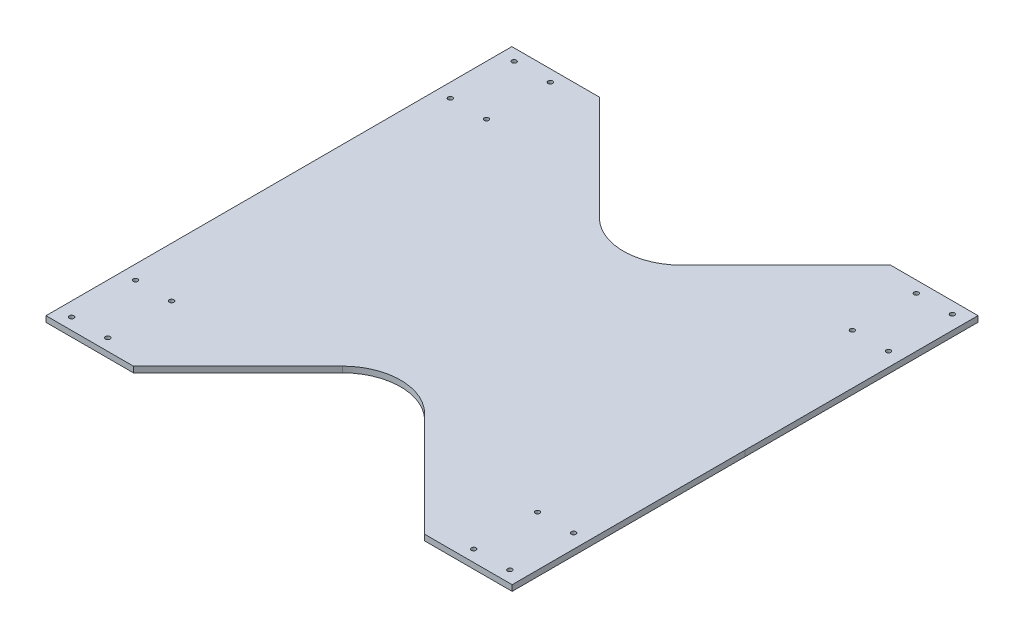
ISO-10303-21;
HEADER;
FILE_DESCRIPTION(('STEP AP214'),'2;1');
FILE_NAME('part.step','',(''),(''),'','','');
FILE_SCHEMA(('AUTOMOTIVE_DESIGN { 1 0 10303 214 1 1 1 1 }'));
ENDSEC;
DATA;
#1=APPLICATION_CONTEXT('core data for automotive mechanical design processes');
#2=APPLICATION_PROTOCOL_DEFINITION('international standard','automotive_design',2000,#1);
#3=PRODUCT_CONTEXT('',#1,'mechanical');
#4=PRODUCT('Part','Part','',(#3));
#5=PRODUCT_RELATED_PRODUCT_CATEGORY('part','',(#4));
#6=PRODUCT_DEFINITION_FORMATION('','',#4);
#7=PRODUCT_DEFINITION_CONTEXT('part definition',#1,'design');
#8=PRODUCT_DEFINITION('design','',#6,#7);
#9=PRODUCT_DEFINITION_SHAPE('','',#8);
#10=(LENGTH_UNIT() NAMED_UNIT(*) SI_UNIT(.MILLI.,.METRE.));
#11=(NAMED_UNIT(*) PLANE_ANGLE_UNIT() SI_UNIT($,.RADIAN.));
#12=(NAMED_UNIT(*) SI_UNIT($,.STERADIAN.) SOLID_ANGLE_UNIT());
#13=UNCERTAINTY_MEASURE_WITH_UNIT(LENGTH_MEASURE(1.E-05),#10,'distance_accuracy_value','');
#14=(GEOMETRIC_REPRESENTATION_CONTEXT(3) GLOBAL_UNCERTAINTY_ASSIGNED_CONTEXT((#13)) GLOBAL_UNIT_ASSIGNED_CONTEXT((#10,
#11,#12)) REPRESENTATION_CONTEXT('',''));
#15=CARTESIAN_POINT('',(0.,0.,0.));
#16=DIRECTION('',(0.,0.,1.));
#17=DIRECTION('',(1.,0.,0.));
#18=AXIS2_PLACEMENT_3D('',#15,#16,#17);
#19=CARTESIAN_POINT('',(0.,5.,0.));
#20=DIRECTION('',(0.,1.,0.));
#21=DIRECTION('',(0.,0.,1.));
#22=AXIS2_PLACEMENT_3D('',#19,#20,#21);
#23=PLANE('',#22);
#24=CARTESIAN_POINT('',(-328.438138966952,5.,-193.693066961914));
#25=DIRECTION('',(0.,1.,0.));
#26=DIRECTION('',(0.,0.,-1.));
#27=AXIS2_PLACEMENT_3D('',#24,#25,#26);
#28=CIRCLE('',#27,1.94999999999997);
#29=CARTESIAN_POINT('',(-328.438138966952,5.,-195.643066961914));
#30=VERTEX_POINT('',#29);
#31=EDGE_CURVE('E502',#30,#30,#28,.T.);
#32=ORIENTED_EDGE('',*,*,#31,.F.);
#33=EDGE_LOOP('',(#32));
#34=FACE_BOUND('',#33,.T.);
#35=CARTESIAN_POINT('',(-359.412846634247,5.,-138.838777385568));
#36=DIRECTION('',(0.,1.,0.));
#37=DIRECTION('',(0.,0.,-1.));
#38=AXIS2_PLACEMENT_3D('',#35,#36,#37);
#39=CIRCLE('',#38,1.94999999999997);
#40=CARTESIAN_POINT('',(-359.412846634247,5.,-140.788777385568));
#41=VERTEX_POINT('',#40);
#42=EDGE_CURVE('E522',#41,#41,#39,.T.);
#43=ORIENTED_EDGE('',*,*,#42,.F.);
#44=EDGE_LOOP('',(#43));
#45=FACE_BOUND('',#44,.T.);
#46=CARTESIAN_POINT('',(-328.350517382651,5.,131.486741949441));
#47=DIRECTION('',(0.,1.,0.));
#48=DIRECTION('',(0.,0.,1.));
#49=AXIS2_PLACEMENT_3D('',#46,#47,#48);
#50=CIRCLE('',#49,1.95000000000013);
#51=CARTESIAN_POINT('',(-328.350517382651,5.,133.436741949441));
#52=VERTEX_POINT('',#51);
#53=EDGE_CURVE('E534',#52,#52,#50,.T.);
#54=ORIENTED_EDGE('',*,*,#53,.F.);
#55=EDGE_LOOP('',(#54));
#56=FACE_BOUND('',#55,.T.);
#57=CARTESIAN_POINT('',(-14.2974814610924,5.,186.254330396367));
#58=DIRECTION('',(0.,1.,0.));
#59=DIRECTION('',(0.,0.,-1.));
#60=AXIS2_PLACEMENT_3D('',#57,#58,#59);
#61=CIRCLE('',#60,1.94999999999994);
#62=CARTESIAN_POINT('',(-14.2974814610924,5.,184.304330396367));
#63=VERTEX_POINT('',#62);
#64=EDGE_CURVE('E546',#63,#63,#61,.T.);
#65=ORIENTED_EDGE('',*,*,#64,.F.);
#66=EDGE_LOOP('',(#65));
#67=FACE_BOUND('',#66,.T.);
#68=CARTESIAN_POINT('',(-14.3227704976897,5.,131.414336227288));
#69=DIRECTION('',(0.,1.,0.));
#70=DIRECTION('',(0.,0.,-1.));
#71=AXIS2_PLACEMENT_3D('',#68,#69,#70);
#72=CIRCLE('',#71,1.95000000000007);
#73=CARTESIAN_POINT('',(-14.3227704976897,5.,129.464336227288));
#74=VERTEX_POINT('',#73);
#75=EDGE_CURVE('E558',#74,#74,#72,.T.);
#76=ORIENTED_EDGE('',*,*,#75,.F.);
#77=EDGE_LOOP('',(#76));
#78=FACE_BOUND('',#77,.T.);
#79=CARTESIAN_POINT('',(-328.350517382651,5.,186.326741949441));
#80=DIRECTION('',(0.,1.,0.));
#81=DIRECTION('',(0.,0.,1.));
#82=AXIS2_PLACEMENT_3D('',#79,#80,#81);
#83=CIRCLE('',#82,1.94999999999992);
#84=CARTESIAN_POINT('',(-328.350517382651,5.,188.276741949441));
#85=VERTEX_POINT('',#84);
#86=EDGE_CURVE('E570',#85,#85,#83,.T.);
#87=ORIENTED_EDGE('',*,*,#86,.F.);
#88=EDGE_LOOP('',(#87));
#89=FACE_BOUND('',#88,.T.);
#90=CARTESIAN_POINT('',(-14.3851030453936,5.,-138.925478514988));
#91=DIRECTION('',(0.,1.,0.));
#92=DIRECTION('',(0.,0.,1.));
#93=AXIS2_PLACEMENT_3D('',#90,#91,#92);
#94=CIRCLE('',#93,1.95000000000001);
#95=CARTESIAN_POINT('',(-14.3851030453936,5.,-136.975478514988));
#96=VERTEX_POINT('',#95);
#97=EDGE_CURVE('E582',#96,#96,#94,.T.);
#98=ORIENTED_EDGE('',*,*,#97,.F.);
#99=EDGE_LOOP('',(#98));
#100=FACE_BOUND('',#99,.T.);
#101=CARTESIAN_POINT('',(16.6148969546064,5.,-193.765478514988));
#102=DIRECTION('',(0.,1.,0.));
#103=DIRECTION('',(0.,0.,1.));
#104=AXIS2_PLACEMENT_3D('',#101,#102,#103);
#105=CIRCLE('',#104,1.95);
#106=CARTESIAN_POINT('',(16.6148969546064,5.,-191.815478514988));
#107=VERTEX_POINT('',#106);
#108=EDGE_CURVE('E594',#107,#107,#105,.T.);
#109=ORIENTED_EDGE('',*,*,#108,.F.);
#110=EDGE_LOOP('',(#109));
#111=FACE_BOUND('',#110,.T.);
#112=DIRECTION('',(-0.706976362509081,0.,0.707237175814047));
#113=VECTOR('',#112,1.);
#114=CARTESIAN_POINT('',(-171.385103045394,5.,-78.7193642955467));
#115=LINE('',#114,#113);
#116=CARTESIAN_POINT('',(-46.3851030453936,5.,-203.765478514988));
#117=VERTEX_POINT('',#116);
#118=CARTESIAN_POINT('',(-136.039547340555,5.,-114.077959462082));
#119=VERTEX_POINT('',#118);
#120=EDGE_CURVE('E616',#117,#119,#115,.T.);
#121=ORIENTED_EDGE('',*,*,#120,.T.);
#122=CARTESIAN_POINT('',(-171.401406131257,5.,-149.426777587536));
#123=DIRECTION('',(0.,1.,0.));
#124=DIRECTION('',(0.,0.,1.));
#125=AXIS2_PLACEMENT_3D('',#122,#123,#124);
#126=CIRCLE('',#125,50.);
#127=CARTESIAN_POINT('',(-206.746960331379,5.,-114.061656376288));
#128=VERTEX_POINT('',#127);
#129=EDGE_CURVE('E142',#119,#128,#126,.F.);
#130=ORIENTED_EDGE('',*,*,#129,.T.);
#131=DIRECTION('',(-0.707302424224961,0.,-0.706911084002432));
#132=VECTOR('',#131,1.);
#133=CARTESIAN_POINT('',(-171.385103045394,5.,-78.7193642955467));
#134=LINE('',#133,#132);
#135=CARTESIAN_POINT('',(-296.442753791085,5.,-203.707822448091));
#136=VERTEX_POINT('',#135);
#137=EDGE_CURVE('E135',#128,#136,#134,.T.);
#138=ORIENTED_EDGE('',*,*,#137,.T.);
#139=DIRECTION('',(-0.999999893673944,0.,0.000461142169899675));
#140=VECTOR('',#139,1.);
#141=CARTESIAN_POINT('',(-296.442753791085,5.,-203.707822448091));
#142=LINE('',#141,#140);
#143=CARTESIAN_POINT('',(-371.442745816631,5.,-203.673236785348));
#144=VERTEX_POINT('',#143);
#145=EDGE_CURVE('E139',#136,#144,#142,.T.);
#146=ORIENTED_EDGE('',*,*,#145,.T.);
#147=DIRECTION('',(0.000461142169899398,0.,0.999999893673944));
#148=VECTOR('',#147,1.);
#149=CARTESIAN_POINT('',(-371.442745816631,5.,-203.673236785348));
#150=LINE('',#149,#148);
#151=CARTESIAN_POINT('',(-371.350517382651,5.,-3.67325805055938));
#152=VERTEX_POINT('',#151);
#153=EDGE_CURVE('E156',#144,#152,#150,.T.);
#154=ORIENTED_EDGE('',*,*,#153,.T.);
#155=DIRECTION('',(0.,0.,1.));
#156=VECTOR('',#155,1.);
#157=CARTESIAN_POINT('',(-371.350517382651,5.,196.326741949441));
#158=LINE('',#157,#156);
#159=CARTESIAN_POINT('',(-371.350517382651,5.,196.326741949441));
#160=VERTEX_POINT('',#159);
#161=EDGE_CURVE('E600',#152,#160,#158,.T.);
#162=ORIENTED_EDGE('',*,*,#161,.T.);
#163=DIRECTION('',(1.,0.,0.));
#164=VECTOR('',#163,1.);
#165=CARTESIAN_POINT('',(-296.350517382651,5.,196.326741949441));
#166=LINE('',#165,#164);
#167=CARTESIAN_POINT('',(-296.350517382651,5.,196.326741949441));
#168=VERTEX_POINT('',#167);
#169=EDGE_CURVE('E602',#160,#168,#166,.T.);
#170=ORIENTED_EDGE('',*,*,#169,.T.);
#171=DIRECTION('',(0.70697636250908,0.,-0.707237175814047));
#172=VECTOR('',#171,1.);
#173=CARTESIAN_POINT('',(-171.350517382651,5.,71.2806277299991));
#174=LINE('',#173,#172);
#175=CARTESIAN_POINT('',(-206.69607308749,5.,106.639222896534));
#176=VERTEX_POINT('',#175);
#177=EDGE_CURVE('E604',#168,#176,#174,.T.);
#178=ORIENTED_EDGE('',*,*,#177,.T.);
#179=CARTESIAN_POINT('',(-171.334214296788,5.,141.988041021988));
#180=DIRECTION('',(0.,1.,0.));
#181=DIRECTION('',(0.,0.,1.));
#182=AXIS2_PLACEMENT_3D('',#179,#180,#181);
#183=CIRCLE('',#182,50.);
#184=CARTESIAN_POINT('',(-135.988660096666,5.,106.62291981074));
#185=VERTEX_POINT('',#184);
#186=EDGE_CURVE('E11',#176,#185,#183,.F.);
#187=ORIENTED_EDGE('',*,*,#186,.T.);
#188=DIRECTION('',(0.707302424224961,0.,0.706911084002432));
#189=VECTOR('',#188,1.);
#190=CARTESIAN_POINT('',(-171.350517382651,5.,71.2806277299991));
#191=LINE('',#190,#189);
#192=CARTESIAN_POINT('',(-46.2928666369596,5.,196.269085882543));
#193=VERTEX_POINT('',#192);
#194=EDGE_CURVE('E606',#185,#193,#191,.T.);
#195=ORIENTED_EDGE('',*,*,#194,.T.);
#196=DIRECTION('',(0.999999893673944,0.,-0.000461142169899305));
#197=VECTOR('',#196,1.);
#198=CARTESIAN_POINT('',(-46.2928666369596,5.,196.269085882543));
#199=LINE('',#198,#197);
#200=CARTESIAN_POINT('',(28.7071253885862,5.,196.234500219801));
#201=VERTEX_POINT('',#200);
#202=EDGE_CURVE('E608',#193,#201,#199,.T.);
#203=ORIENTED_EDGE('',*,*,#202,.T.);
#204=DIRECTION('',(-0.000461142169898981,0.,-0.999999893673944));
#205=VECTOR('',#204,1.);
#206=CARTESIAN_POINT('',(28.7071253885862,5.,196.234500219801));
#207=LINE('',#206,#205);
#208=CARTESIAN_POINT('',(28.6148969546064,5.,-3.76547851498826));
#209=VERTEX_POINT('',#208);
#210=EDGE_CURVE('E610',#201,#209,#207,.T.);
#211=ORIENTED_EDGE('',*,*,#210,.T.);
#212=DIRECTION('',(0.,0.,-1.));
#213=VECTOR('',#212,1.);
#214=CARTESIAN_POINT('',(28.6148969546064,5.,-203.765478514988));
#215=LINE('',#214,#213);
#216=CARTESIAN_POINT('',(28.6148969546064,5.,-203.765478514988));
#217=VERTEX_POINT('',#216);
#218=EDGE_CURVE('E612',#209,#217,#215,.T.);
#219=ORIENTED_EDGE('',*,*,#218,.T.);
#220=DIRECTION('',(-1.,0.,0.));
#221=VECTOR('',#220,1.);
#222=CARTESIAN_POINT('',(-46.3851030453936,5.,-203.765478514988));
#223=LINE('',#222,#221);
#224=EDGE_CURVE('E614',#217,#117,#223,.T.);
#225=ORIENTED_EDGE('',*,*,#224,.T.);
#226=EDGE_LOOP('',(#121,#130,#138,#146,#154,#162,#170,#178,#187,#195,#203,#211,#219,#225));
#227=FACE_BOUND('',#226,.T.);
#228=CARTESIAN_POINT('',(-14.3851030453936,5.,-193.765478514988));
#229=DIRECTION('',(0.,1.,0.));
#230=DIRECTION('',(0.,0.,1.));
#231=AXIS2_PLACEMENT_3D('',#228,#229,#230);
#232=CIRCLE('',#231,1.95000000000001);
#233=CARTESIAN_POINT('',(-14.3851030453936,5.,-191.815478514988));
#234=VERTEX_POINT('',#233);
#235=EDGE_CURVE('E588',#234,#234,#232,.T.);
#236=ORIENTED_EDGE('',*,*,#235,.F.);
#237=EDGE_LOOP('',(#236));
#238=FACE_BOUND('',#237,.T.);
#239=CARTESIAN_POINT('',(16.6148969546064,5.,-138.925478514988));
#240=DIRECTION('',(0.,1.,0.));
#241=DIRECTION('',(0.,0.,1.));
#242=AXIS2_PLACEMENT_3D('',#239,#240,#241);
#243=CIRCLE('',#242,1.95);
#244=CARTESIAN_POINT('',(16.6148969546064,5.,-136.975478514988));
#245=VERTEX_POINT('',#244);
#246=EDGE_CURVE('E576',#245,#245,#243,.T.);
#247=ORIENTED_EDGE('',*,*,#246,.F.);
#248=EDGE_LOOP('',(#247));
#249=FACE_BOUND('',#248,.T.);
#250=CARTESIAN_POINT('',(16.6772262062025,5.,131.400040820021));
#251=DIRECTION('',(0.,1.,0.));
#252=DIRECTION('',(0.,0.,-1.));
#253=AXIS2_PLACEMENT_3D('',#250,#251,#252);
#254=CIRCLE('',#253,1.94999999999999);
#255=CARTESIAN_POINT('',(16.6772262062025,5.,129.450040820021));
#256=VERTEX_POINT('',#255);
#257=EDGE_CURVE('E564',#256,#256,#254,.T.);
#258=ORIENTED_EDGE('',*,*,#257,.F.);
#259=EDGE_LOOP('',(#258));
#260=FACE_BOUND('',#259,.T.);
#261=CARTESIAN_POINT('',(16.7025152427999,5.,186.2400349891));
#262=DIRECTION('',(0.,1.,0.));
#263=DIRECTION('',(0.,0.,-1.));
#264=AXIS2_PLACEMENT_3D('',#261,#262,#263);
#265=CIRCLE('',#264,1.9499999999999);
#266=CARTESIAN_POINT('',(16.7025152427999,5.,184.2900349891));
#267=VERTEX_POINT('',#266);
#268=EDGE_CURVE('E552',#267,#267,#265,.T.);
#269=ORIENTED_EDGE('',*,*,#268,.F.);
#270=EDGE_LOOP('',(#269));
#271=FACE_BOUND('',#270,.T.);
#272=CARTESIAN_POINT('',(-359.350517382651,5.,186.326741949441));
#273=DIRECTION('',(0.,1.,0.));
#274=DIRECTION('',(0.,0.,1.));
#275=AXIS2_PLACEMENT_3D('',#272,#273,#274);
#276=CIRCLE('',#275,1.94999999999987);
#277=CARTESIAN_POINT('',(-359.350517382651,5.,188.276741949441));
#278=VERTEX_POINT('',#277);
#279=EDGE_CURVE('E540',#278,#278,#276,.T.);
#280=ORIENTED_EDGE('',*,*,#279,.F.);
#281=EDGE_LOOP('',(#280));
#282=FACE_BOUND('',#281,.T.);
#283=CARTESIAN_POINT('',(-359.350517382651,5.,131.486741949441));
#284=DIRECTION('',(0.,1.,0.));
#285=DIRECTION('',(0.,0.,1.));
#286=AXIS2_PLACEMENT_3D('',#283,#284,#285);
#287=CIRCLE('',#286,1.94999999999994);
#288=CARTESIAN_POINT('',(-359.350517382651,5.,133.436741949441));
#289=VERTEX_POINT('',#288);
#290=EDGE_CURVE('E528',#289,#289,#287,.T.);
#291=ORIENTED_EDGE('',*,*,#290,.F.);
#292=EDGE_LOOP('',(#291));
#293=FACE_BOUND('',#292,.T.);
#294=CARTESIAN_POINT('',(-328.412849930355,5.,-138.853072792835));
#295=DIRECTION('',(0.,1.,0.));
#296=DIRECTION('',(0.,0.,-1.));
#297=AXIS2_PLACEMENT_3D('',#294,#295,#296);
#298=CIRCLE('',#297,1.95000000000007);
#299=CARTESIAN_POINT('',(-328.412849930355,5.,-140.803072792835));
#300=VERTEX_POINT('',#299);
#301=EDGE_CURVE('E516',#300,#300,#298,.T.);
#302=ORIENTED_EDGE('',*,*,#301,.F.);
#303=EDGE_LOOP('',(#302));
#304=FACE_BOUND('',#303,.T.);
#305=CARTESIAN_POINT('',(-359.438135670845,5.,-193.678771554648));
#306=DIRECTION('',(0.,1.,0.));
#307=DIRECTION('',(0.,0.,-1.));
#308=AXIS2_PLACEMENT_3D('',#305,#306,#307);
#309=CIRCLE('',#308,1.95000000000001);
#310=CARTESIAN_POINT('',(-359.438135670845,5.,-195.628771554648));
#311=VERTEX_POINT('',#310);
#312=EDGE_CURVE('E507',#311,#311,#309,.T.);
#313=ORIENTED_EDGE('',*,*,#312,.F.);
#314=EDGE_LOOP('',(#313));
#315=FACE_BOUND('',#314,.T.);
#316=ADVANCED_FACE('F35',(#34,#45,#56,#67,#78,#89,#100,#111,#227,#238,#249,#260,#271,#282,#293,
#304,#315),#23,.T.);
#317=CARTESIAN_POINT('',(0.,0.,0.));
#318=DIRECTION('',(0.,1.,0.));
#319=DIRECTION('',(0.,0.,1.));
#320=AXIS2_PLACEMENT_3D('',#317,#318,#319);
#321=PLANE('',#320);
#322=DIRECTION('',(-0.707302424224961,0.,-0.706911084002432));
#323=VECTOR('',#322,1.);
#324=CARTESIAN_POINT('',(-171.385103045394,0.,-78.7193642955467));
#325=LINE('',#324,#323);
#326=CARTESIAN_POINT('',(-206.746960331379,0.,-114.061656376288));
#327=VERTEX_POINT('',#326);
#328=CARTESIAN_POINT('',(-296.442753791085,0.,-203.707822448091));
#329=VERTEX_POINT('',#328);
#330=EDGE_CURVE('E160',#327,#329,#325,.T.);
#331=ORIENTED_EDGE('',*,*,#330,.F.);
#332=CARTESIAN_POINT('',(-171.401406131257,0.,-149.426777587536));
#333=DIRECTION('',(0.,1.,0.));
#334=DIRECTION('',(0.,0.,1.));
#335=AXIS2_PLACEMENT_3D('',#332,#333,#334);
#336=CIRCLE('',#335,50.);
#337=CARTESIAN_POINT('',(-136.039547340555,0.,-114.077959462082));
#338=VERTEX_POINT('',#337);
#339=EDGE_CURVE('E175',#327,#338,#336,.T.);
#340=ORIENTED_EDGE('',*,*,#339,.T.);
#341=DIRECTION('',(-0.706976362509081,0.,0.707237175814047));
#342=VECTOR('',#341,1.);
#343=CARTESIAN_POINT('',(-171.385103045394,0.,-78.7193642955467));
#344=LINE('',#343,#342);
#345=CARTESIAN_POINT('',(-46.3851030453936,0.,-203.765478514988));
#346=VERTEX_POINT('',#345);
#347=EDGE_CURVE('E147',#346,#338,#344,.T.);
#348=ORIENTED_EDGE('',*,*,#347,.F.);
#349=DIRECTION('',(-1.,0.,0.));
#350=VECTOR('',#349,1.);
#351=CARTESIAN_POINT('',(-46.3851030453936,0.,-203.765478514988));
#352=LINE('',#351,#350);
#353=CARTESIAN_POINT('',(28.6148969546064,0.,-203.765478514988));
#354=VERTEX_POINT('',#353);
#355=EDGE_CURVE('E190',#354,#346,#352,.T.);
#356=ORIENTED_EDGE('',*,*,#355,.F.);
#357=DIRECTION('',(0.,0.,-1.));
#358=VECTOR('',#357,1.);
#359=CARTESIAN_POINT('',(28.6148969546064,0.,-203.765478514988));
#360=LINE('',#359,#358);
#361=CARTESIAN_POINT('',(28.6148969546064,0.,-3.76547851498826));
#362=VERTEX_POINT('',#361);
#363=EDGE_CURVE('E635',#362,#354,#360,.T.);
#364=ORIENTED_EDGE('',*,*,#363,.F.);
#365=DIRECTION('',(-0.000461142169898981,0.,-0.999999893673944));
#366=VECTOR('',#365,1.);
#367=CARTESIAN_POINT('',(28.7071253885862,0.,196.234500219801));
#368=LINE('',#367,#366);
#369=CARTESIAN_POINT('',(28.7071253885862,0.,196.234500219801));
#370=VERTEX_POINT('',#369);
#371=EDGE_CURVE('E633',#370,#362,#368,.T.);
#372=ORIENTED_EDGE('',*,*,#371,.F.);
#373=DIRECTION('',(0.999999893673944,0.,-0.000461142169899305));
#374=VECTOR('',#373,1.);
#375=CARTESIAN_POINT('',(-46.2928666369596,0.,196.269085882543));
#376=LINE('',#375,#374);
#377=CARTESIAN_POINT('',(-46.2928666369596,0.,196.269085882543));
#378=VERTEX_POINT('',#377);
#379=EDGE_CURVE('E631',#378,#370,#376,.T.);
#380=ORIENTED_EDGE('',*,*,#379,.F.);
#381=DIRECTION('',(0.707302424224961,0.,0.706911084002432));
#382=VECTOR('',#381,1.);
#383=CARTESIAN_POINT('',(-171.350517382651,0.,71.2806277299991));
#384=LINE('',#383,#382);
#385=CARTESIAN_POINT('',(-135.988660096666,0.,106.62291981074));
#386=VERTEX_POINT('',#385);
#387=EDGE_CURVE('E629',#386,#378,#384,.T.);
#388=ORIENTED_EDGE('',*,*,#387,.F.);
#389=CARTESIAN_POINT('',(-171.334214296788,0.,141.988041021988));
#390=DIRECTION('',(0.,1.,0.));
#391=DIRECTION('',(0.,0.,1.));
#392=AXIS2_PLACEMENT_3D('',#389,#390,#391);
#393=CIRCLE('',#392,50.);
#394=CARTESIAN_POINT('',(-206.69607308749,0.,106.639222896534));
#395=VERTEX_POINT('',#394);
#396=EDGE_CURVE('E43',#386,#395,#393,.T.);
#397=ORIENTED_EDGE('',*,*,#396,.T.);
#398=DIRECTION('',(0.70697636250908,0.,-0.707237175814047));
#399=VECTOR('',#398,1.);
#400=CARTESIAN_POINT('',(-171.350517382651,0.,71.2806277299991));
#401=LINE('',#400,#399);
#402=CARTESIAN_POINT('',(-296.350517382651,0.,196.326741949441));
#403=VERTEX_POINT('',#402);
#404=EDGE_CURVE('E627',#403,#395,#401,.T.);
#405=ORIENTED_EDGE('',*,*,#404,.F.);
#406=DIRECTION('',(1.,0.,0.));
#407=VECTOR('',#406,1.);
#408=CARTESIAN_POINT('',(-296.350517382651,0.,196.326741949441));
#409=LINE('',#408,#407);
#410=CARTESIAN_POINT('',(-371.350517382651,0.,196.326741949441));
#411=VERTEX_POINT('',#410);
#412=EDGE_CURVE('E625',#411,#403,#409,.T.);
#413=ORIENTED_EDGE('',*,*,#412,.F.);
#414=DIRECTION('',(0.,0.,1.));
#415=VECTOR('',#414,1.);
#416=CARTESIAN_POINT('',(-371.350517382651,0.,196.326741949441));
#417=LINE('',#416,#415);
#418=CARTESIAN_POINT('',(-371.350517382651,0.,-3.67325805055938));
#419=VERTEX_POINT('',#418);
#420=EDGE_CURVE('E623',#419,#411,#417,.T.);
#421=ORIENTED_EDGE('',*,*,#420,.F.);
#422=DIRECTION('',(0.000461142169899398,0.,0.999999893673944));
#423=VECTOR('',#422,1.);
#424=CARTESIAN_POINT('',(-371.442745816631,0.,-203.673236785348));
#425=LINE('',#424,#423);
#426=CARTESIAN_POINT('',(-371.442745816631,0.,-203.673236785348));
#427=VERTEX_POINT('',#426);
#428=EDGE_CURVE('E621',#427,#419,#425,.T.);
#429=ORIENTED_EDGE('',*,*,#428,.F.);
#430=DIRECTION('',(-0.999999893673944,0.,0.000461142169899675));
#431=VECTOR('',#430,1.);
#432=CARTESIAN_POINT('',(-296.442753791085,0.,-203.707822448091));
#433=LINE('',#432,#431);
#434=EDGE_CURVE('E619',#329,#427,#433,.T.);
#435=ORIENTED_EDGE('',*,*,#434,.F.);
#436=EDGE_LOOP('',(#331,#340,#348,#356,#364,#372,#380,#388,#397,#405,#413,#421,#429,#435));
#437=FACE_BOUND('',#436,.T.);
#438=CARTESIAN_POINT('',(16.6148969546064,0.,-193.765478514988));
#439=DIRECTION('',(0.,1.,0.));
#440=DIRECTION('',(0.,0.,1.));
#441=AXIS2_PLACEMENT_3D('',#438,#439,#440);
#442=CIRCLE('',#441,1.95);
#443=CARTESIAN_POINT('',(16.6148969546064,0.,-191.815478514988));
#444=VERTEX_POINT('',#443);
#445=EDGE_CURVE('E591',#444,#444,#442,.T.);
#446=ORIENTED_EDGE('',*,*,#445,.T.);
#447=EDGE_LOOP('',(#446));
#448=FACE_BOUND('',#447,.T.);
#449=CARTESIAN_POINT('',(-14.3851030453936,0.,-193.765478514988));
#450=DIRECTION('',(0.,1.,0.));
#451=DIRECTION('',(0.,0.,1.));
#452=AXIS2_PLACEMENT_3D('',#449,#450,#451);
#453=CIRCLE('',#452,1.95000000000001);
#454=CARTESIAN_POINT('',(-14.3851030453936,0.,-191.815478514988));
#455=VERTEX_POINT('',#454);
#456=EDGE_CURVE('E585',#455,#455,#453,.T.);
#457=ORIENTED_EDGE('',*,*,#456,.T.);
#458=EDGE_LOOP('',(#457));
#459=FACE_BOUND('',#458,.T.);
#460=CARTESIAN_POINT('',(-14.3851030453936,0.,-138.925478514988));
#461=DIRECTION('',(0.,1.,0.));
#462=DIRECTION('',(0.,0.,1.));
#463=AXIS2_PLACEMENT_3D('',#460,#461,#462);
#464=CIRCLE('',#463,1.95000000000001);
#465=CARTESIAN_POINT('',(-14.3851030453936,0.,-136.975478514988));
#466=VERTEX_POINT('',#465);
#467=EDGE_CURVE('E579',#466,#466,#464,.T.);
#468=ORIENTED_EDGE('',*,*,#467,.T.);
#469=EDGE_LOOP('',(#468));
#470=FACE_BOUND('',#469,.T.);
#471=CARTESIAN_POINT('',(16.6148969546064,0.,-138.925478514988));
#472=DIRECTION('',(0.,1.,0.));
#473=DIRECTION('',(0.,0.,1.));
#474=AXIS2_PLACEMENT_3D('',#471,#472,#473);
#475=CIRCLE('',#474,1.95);
#476=CARTESIAN_POINT('',(16.6148969546064,0.,-136.975478514988));
#477=VERTEX_POINT('',#476);
#478=EDGE_CURVE('E573',#477,#477,#475,.T.);
#479=ORIENTED_EDGE('',*,*,#478,.T.);
#480=EDGE_LOOP('',(#479));
#481=FACE_BOUND('',#480,.T.);
#482=CARTESIAN_POINT('',(-328.350517382651,0.,186.326741949441));
#483=DIRECTION('',(0.,1.,0.));
#484=DIRECTION('',(0.,0.,1.));
#485=AXIS2_PLACEMENT_3D('',#482,#483,#484);
#486=CIRCLE('',#485,1.94999999999992);
#487=CARTESIAN_POINT('',(-328.350517382651,0.,188.276741949441));
#488=VERTEX_POINT('',#487);
#489=EDGE_CURVE('E567',#488,#488,#486,.T.);
#490=ORIENTED_EDGE('',*,*,#489,.T.);
#491=EDGE_LOOP('',(#490));
#492=FACE_BOUND('',#491,.T.);
#493=CARTESIAN_POINT('',(16.6772262062025,0.,131.400040820021));
#494=DIRECTION('',(0.,1.,0.));
#495=DIRECTION('',(0.,0.,-1.));
#496=AXIS2_PLACEMENT_3D('',#493,#494,#495);
#497=CIRCLE('',#496,1.94999999999999);
#498=CARTESIAN_POINT('',(16.6772262062025,0.,129.450040820021));
#499=VERTEX_POINT('',#498);
#500=EDGE_CURVE('E561',#499,#499,#497,.T.);
#501=ORIENTED_EDGE('',*,*,#500,.T.);
#502=EDGE_LOOP('',(#501));
#503=FACE_BOUND('',#502,.T.);
#504=CARTESIAN_POINT('',(-14.3227704976897,0.,131.414336227288));
#505=DIRECTION('',(0.,1.,0.));
#506=DIRECTION('',(0.,0.,-1.));
#507=AXIS2_PLACEMENT_3D('',#504,#505,#506);
#508=CIRCLE('',#507,1.95000000000007);
#509=CARTESIAN_POINT('',(-14.3227704976897,0.,129.464336227288));
#510=VERTEX_POINT('',#509);
#511=EDGE_CURVE('E555',#510,#510,#508,.T.);
#512=ORIENTED_EDGE('',*,*,#511,.T.);
#513=EDGE_LOOP('',(#512));
#514=FACE_BOUND('',#513,.T.);
#515=CARTESIAN_POINT('',(16.7025152427999,0.,186.2400349891));
#516=DIRECTION('',(0.,1.,0.));
#517=DIRECTION('',(0.,0.,-1.));
#518=AXIS2_PLACEMENT_3D('',#515,#516,#517);
#519=CIRCLE('',#518,1.9499999999999);
#520=CARTESIAN_POINT('',(16.7025152427999,0.,184.2900349891));
#521=VERTEX_POINT('',#520);
#522=EDGE_CURVE('E549',#521,#521,#519,.T.);
#523=ORIENTED_EDGE('',*,*,#522,.T.);
#524=EDGE_LOOP('',(#523));
#525=FACE_BOUND('',#524,.T.);
#526=CARTESIAN_POINT('',(-14.2974814610924,0.,186.254330396367));
#527=DIRECTION('',(0.,1.,0.));
#528=DIRECTION('',(0.,0.,-1.));
#529=AXIS2_PLACEMENT_3D('',#526,#527,#528);
#530=CIRCLE('',#529,1.94999999999994);
#531=CARTESIAN_POINT('',(-14.2974814610924,0.,184.304330396367));
#532=VERTEX_POINT('',#531);
#533=EDGE_CURVE('E543',#532,#532,#530,.T.);
#534=ORIENTED_EDGE('',*,*,#533,.T.);
#535=EDGE_LOOP('',(#534));
#536=FACE_BOUND('',#535,.T.);
#537=CARTESIAN_POINT('',(-359.350517382651,0.,186.326741949441));
#538=DIRECTION('',(0.,1.,0.));
#539=DIRECTION('',(0.,0.,1.));
#540=AXIS2_PLACEMENT_3D('',#537,#538,#539);
#541=CIRCLE('',#540,1.94999999999987);
#542=CARTESIAN_POINT('',(-359.350517382651,0.,188.276741949441));
#543=VERTEX_POINT('',#542);
#544=EDGE_CURVE('E537',#543,#543,#541,.T.);
#545=ORIENTED_EDGE('',*,*,#544,.T.);
#546=EDGE_LOOP('',(#545));
#547=FACE_BOUND('',#546,.T.);
#548=CARTESIAN_POINT('',(-328.350517382651,0.,131.486741949441));
#549=DIRECTION('',(0.,1.,0.));
#550=DIRECTION('',(0.,0.,1.));
#551=AXIS2_PLACEMENT_3D('',#548,#549,#550);
#552=CIRCLE('',#551,1.95000000000013);
#553=CARTESIAN_POINT('',(-328.350517382651,0.,133.436741949441));
#554=VERTEX_POINT('',#553);
#555=EDGE_CURVE('E531',#554,#554,#552,.T.);
#556=ORIENTED_EDGE('',*,*,#555,.T.);
#557=EDGE_LOOP('',(#556));
#558=FACE_BOUND('',#557,.T.);
#559=CARTESIAN_POINT('',(-359.350517382651,0.,131.486741949441));
#560=DIRECTION('',(0.,1.,0.));
#561=DIRECTION('',(0.,0.,1.));
#562=AXIS2_PLACEMENT_3D('',#559,#560,#561);
#563=CIRCLE('',#562,1.94999999999994);
#564=CARTESIAN_POINT('',(-359.350517382651,0.,133.436741949441));
#565=VERTEX_POINT('',#564);
#566=EDGE_CURVE('E525',#565,#565,#563,.T.);
#567=ORIENTED_EDGE('',*,*,#566,.T.);
#568=EDGE_LOOP('',(#567));
#569=FACE_BOUND('',#568,.T.);
#570=CARTESIAN_POINT('',(-359.412846634247,0.,-138.838777385568));
#571=DIRECTION('',(0.,1.,0.));
#572=DIRECTION('',(0.,0.,-1.));
#573=AXIS2_PLACEMENT_3D('',#570,#571,#572);
#574=CIRCLE('',#573,1.94999999999997);
#575=CARTESIAN_POINT('',(-359.412846634247,0.,-140.788777385568));
#576=VERTEX_POINT('',#575);
#577=EDGE_CURVE('E519',#576,#576,#574,.T.);
#578=ORIENTED_EDGE('',*,*,#577,.T.);
#579=EDGE_LOOP('',(#578));
#580=FACE_BOUND('',#579,.T.);
#581=CARTESIAN_POINT('',(-328.412849930355,0.,-138.853072792835));
#582=DIRECTION('',(0.,1.,0.));
#583=DIRECTION('',(0.,0.,-1.));
#584=AXIS2_PLACEMENT_3D('',#581,#582,#583);
#585=CIRCLE('',#584,1.95000000000007);
#586=CARTESIAN_POINT('',(-328.412849930355,0.,-140.803072792835));
#587=VERTEX_POINT('',#586);
#588=EDGE_CURVE('E509',#587,#587,#585,.T.);
#589=ORIENTED_EDGE('',*,*,#588,.T.);
#590=EDGE_LOOP('',(#589));
#591=FACE_BOUND('',#590,.T.);
#592=CARTESIAN_POINT('',(-328.438138966952,0.,-193.693066961914));
#593=DIRECTION('',(0.,1.,0.));
#594=DIRECTION('',(0.,0.,-1.));
#595=AXIS2_PLACEMENT_3D('',#592,#593,#594);
#596=CIRCLE('',#595,1.94999999999997);
#597=CARTESIAN_POINT('',(-328.438138966952,0.,-195.643066961914));
#598=VERTEX_POINT('',#597);
#599=EDGE_CURVE('E505',#598,#598,#596,.T.);
#600=ORIENTED_EDGE('',*,*,#599,.T.);
#601=EDGE_LOOP('',(#600));
#602=FACE_BOUND('',#601,.T.);
#603=CARTESIAN_POINT('',(-359.438135670845,0.,-193.678771554648));
#604=DIRECTION('',(0.,1.,0.));
#605=DIRECTION('',(0.,0.,-1.));
#606=AXIS2_PLACEMENT_3D('',#603,#604,#605);
#607=CIRCLE('',#606,1.95000000000001);
#608=CARTESIAN_POINT('',(-359.438135670845,0.,-195.628771554648));
#609=VERTEX_POINT('',#608);
#610=EDGE_CURVE('E512',#609,#609,#607,.T.);
#611=ORIENTED_EDGE('',*,*,#610,.T.);
#612=EDGE_LOOP('',(#611));
#613=FACE_BOUND('',#612,.T.);
#614=ADVANCED_FACE('F179',(#437,#448,#459,#470,#481,#492,#503,#514,#525,#536,#547,#558,#569,
#580,#591,#602,#613),#321,.F.);
#615=CARTESIAN_POINT('',(-171.385103045394,5.,-78.7193642955467));
#616=DIRECTION('',(-0.706911084002432,0.,0.707302424224961));
#617=DIRECTION('',(0.707302424224961,0.,0.706911084002432));
#618=AXIS2_PLACEMENT_3D('',#615,#616,#617);
#619=PLANE('',#618);
#620=ORIENTED_EDGE('',*,*,#137,.F.);
#621=DIRECTION('',(0.,-1.,0.));
#622=VECTOR('',#621,1.);
#623=CARTESIAN_POINT('',(-206.746960331379,0.,-114.061656376288));
#624=LINE('',#623,#622);
#625=EDGE_CURVE('E162',#128,#327,#624,.T.);
#626=ORIENTED_EDGE('',*,*,#625,.T.);
#627=ORIENTED_EDGE('',*,*,#330,.T.);
#628=DIRECTION('',(0.,-1.,0.));
#629=VECTOR('',#628,1.);
#630=CARTESIAN_POINT('',(-296.442753791085,5.,-203.707822448091));
#631=LINE('',#630,#629);
#632=EDGE_CURVE('E152',#136,#329,#631,.T.);
#633=ORIENTED_EDGE('',*,*,#632,.F.);
#634=EDGE_LOOP('',(#620,#626,#627,#633));
#635=FACE_BOUND('',#634,.T.);
#636=ADVANCED_FACE('F158',(#635),#619,.F.);
#637=CARTESIAN_POINT('',(-296.442753791085,5.,-203.707822448091));
#638=DIRECTION('',(0.000461142169899675,0.,0.999999893673944));
#639=DIRECTION('',(0.999999893673944,0.,-0.000461142169899675));
#640=AXIS2_PLACEMENT_3D('',#637,#638,#639);
#641=PLANE('',#640);
#642=ORIENTED_EDGE('',*,*,#434,.T.);
#643=DIRECTION('',(0.,-1.,0.));
#644=VECTOR('',#643,1.);
#645=CARTESIAN_POINT('',(-371.442745816631,5.,-203.673236785348));
#646=LINE('',#645,#644);
#647=EDGE_CURVE('E154',#144,#427,#646,.T.);
#648=ORIENTED_EDGE('',*,*,#647,.F.);
#649=ORIENTED_EDGE('',*,*,#145,.F.);
#650=ORIENTED_EDGE('',*,*,#632,.T.);
#651=EDGE_LOOP('',(#642,#648,#649,#650));
#652=FACE_BOUND('',#651,.T.);
#653=ADVANCED_FACE('F151',(#652),#641,.F.);
#654=CARTESIAN_POINT('',(-371.442745816631,5.,-203.673236785348));
#655=DIRECTION('',(0.999999893673944,0.,-0.000461142169899398));
#656=DIRECTION('',(-0.000461142169899398,0.,-0.999999893673944));
#657=AXIS2_PLACEMENT_3D('',#654,#655,#656);
#658=PLANE('',#657);
#659=ORIENTED_EDGE('',*,*,#428,.T.);
#660=DIRECTION('',(0.,-1.,0.));
#661=VECTOR('',#660,1.);
#662=CARTESIAN_POINT('',(-371.350517382651,5.,-3.67325805055938));
#663=LINE('',#662,#661);
#664=EDGE_CURVE('E166',#152,#419,#663,.T.);
#665=ORIENTED_EDGE('',*,*,#664,.F.);
#666=ORIENTED_EDGE('',*,*,#153,.F.);
#667=ORIENTED_EDGE('',*,*,#647,.T.);
#668=EDGE_LOOP('',(#659,#665,#666,#667));
#669=FACE_BOUND('',#668,.T.);
#670=ADVANCED_FACE('F249',(#669),#658,.F.);
#671=CARTESIAN_POINT('',(-371.350517382651,5.,196.326741949441));
#672=DIRECTION('',(1.,0.,0.));
#673=DIRECTION('',(0.,0.,-1.));
#674=AXIS2_PLACEMENT_3D('',#671,#672,#673);
#675=PLANE('',#674);
#676=ORIENTED_EDGE('',*,*,#420,.T.);
#677=DIRECTION('',(0.,-1.,0.));
#678=VECTOR('',#677,1.);
#679=CARTESIAN_POINT('',(-371.350517382651,5.,196.326741949441));
#680=LINE('',#679,#678);
#681=EDGE_CURVE('E654',#160,#411,#680,.T.);
#682=ORIENTED_EDGE('',*,*,#681,.F.);
#683=ORIENTED_EDGE('',*,*,#161,.F.);
#684=ORIENTED_EDGE('',*,*,#664,.T.);
#685=EDGE_LOOP('',(#676,#682,#683,#684));
#686=FACE_BOUND('',#685,.T.);
#687=ADVANCED_FACE('F245',(#686),#675,.F.);
#688=CARTESIAN_POINT('',(-296.350517382651,5.,196.326741949441));
#689=DIRECTION('',(0.,0.,-1.));
#690=DIRECTION('',(-1.,0.,0.));
#691=AXIS2_PLACEMENT_3D('',#688,#689,#690);
#692=PLANE('',#691);
#693=ORIENTED_EDGE('',*,*,#412,.T.);
#694=DIRECTION('',(0.,-1.,0.));
#695=VECTOR('',#694,1.);
#696=CARTESIAN_POINT('',(-296.350517382651,5.,196.326741949441));
#697=LINE('',#696,#695);
#698=EDGE_CURVE('E651',#168,#403,#697,.T.);
#699=ORIENTED_EDGE('',*,*,#698,.F.);
#700=ORIENTED_EDGE('',*,*,#169,.F.);
#701=ORIENTED_EDGE('',*,*,#681,.T.);
#702=EDGE_LOOP('',(#693,#699,#700,#701));
#703=FACE_BOUND('',#702,.T.);
#704=ADVANCED_FACE('F242',(#703),#692,.F.);
#705=CARTESIAN_POINT('',(-171.350517382651,5.,71.2806277299991));
#706=DIRECTION('',(-0.707237175814047,0.,-0.70697636250908));
#707=DIRECTION('',(-0.70697636250908,0.,0.707237175814047));
#708=AXIS2_PLACEMENT_3D('',#705,#706,#707);
#709=PLANE('',#708);
#710=ORIENTED_EDGE('',*,*,#404,.T.);
#711=DIRECTION('',(0.,-1.,0.));
#712=VECTOR('',#711,1.);
#713=CARTESIAN_POINT('',(-206.69607308749,5.,106.639222896534));
#714=LINE('',#713,#712);
#715=EDGE_CURVE('E50',#395,#176,#714,.F.);
#716=ORIENTED_EDGE('',*,*,#715,.T.);
#717=ORIENTED_EDGE('',*,*,#177,.F.);
#718=ORIENTED_EDGE('',*,*,#698,.T.);
#719=EDGE_LOOP('',(#710,#716,#717,#718));
#720=FACE_BOUND('',#719,.T.);
#721=ADVANCED_FACE('F238',(#720),#709,.F.);
#722=CARTESIAN_POINT('',(-171.350517382651,5.,71.2806277299991));
#723=DIRECTION('',(0.706911084002432,0.,-0.707302424224961));
#724=DIRECTION('',(-0.707302424224961,0.,-0.706911084002432));
#725=AXIS2_PLACEMENT_3D('',#722,#723,#724);
#726=PLANE('',#725);
#727=ORIENTED_EDGE('',*,*,#194,.F.);
#728=DIRECTION('',(0.,-1.,0.));
#729=VECTOR('',#728,1.);
#730=CARTESIAN_POINT('',(-135.988660096666,0.,106.62291981074));
#731=LINE('',#730,#729);
#732=EDGE_CURVE('E171',#185,#386,#731,.T.);
#733=ORIENTED_EDGE('',*,*,#732,.T.);
#734=ORIENTED_EDGE('',*,*,#387,.T.);
#735=DIRECTION('',(0.,-1.,0.));
#736=VECTOR('',#735,1.);
#737=CARTESIAN_POINT('',(-46.2928666369596,5.,196.269085882543));
#738=LINE('',#737,#736);
#739=EDGE_CURVE('E648',#193,#378,#738,.T.);
#740=ORIENTED_EDGE('',*,*,#739,.F.);
#741=EDGE_LOOP('',(#727,#733,#734,#740));
#742=FACE_BOUND('',#741,.T.);
#743=ADVANCED_FACE('F234',(#742),#726,.F.);
#744=CARTESIAN_POINT('',(-46.2928666369596,5.,196.269085882543));
#745=DIRECTION('',(-0.000461142169899305,0.,-0.999999893673944));
#746=DIRECTION('',(-0.999999893673944,0.,0.000461142169899305));
#747=AXIS2_PLACEMENT_3D('',#744,#745,#746);
#748=PLANE('',#747);
#749=ORIENTED_EDGE('',*,*,#379,.T.);
#750=DIRECTION('',(0.,-1.,0.));
#751=VECTOR('',#750,1.);
#752=CARTESIAN_POINT('',(28.7071253885862,5.,196.234500219801));
#753=LINE('',#752,#751);
#754=EDGE_CURVE('E645',#201,#370,#753,.T.);
#755=ORIENTED_EDGE('',*,*,#754,.F.);
#756=ORIENTED_EDGE('',*,*,#202,.F.);
#757=ORIENTED_EDGE('',*,*,#739,.T.);
#758=EDGE_LOOP('',(#749,#755,#756,#757));
#759=FACE_BOUND('',#758,.T.);
#760=ADVANCED_FACE('F230',(#759),#748,.F.);
#761=CARTESIAN_POINT('',(28.7071253885862,5.,196.234500219801));
#762=DIRECTION('',(-0.999999893673944,0.,0.000461142169898981));
#763=DIRECTION('',(0.000461142169898981,0.,0.999999893673944));
#764=AXIS2_PLACEMENT_3D('',#761,#762,#763);
#765=PLANE('',#764);
#766=ORIENTED_EDGE('',*,*,#371,.T.);
#767=DIRECTION('',(0.,-1.,0.));
#768=VECTOR('',#767,1.);
#769=CARTESIAN_POINT('',(28.6148969546064,5.,-3.76547851498826));
#770=LINE('',#769,#768);
#771=EDGE_CURVE('E642',#209,#362,#770,.T.);
#772=ORIENTED_EDGE('',*,*,#771,.F.);
#773=ORIENTED_EDGE('',*,*,#210,.F.);
#774=ORIENTED_EDGE('',*,*,#754,.T.);
#775=EDGE_LOOP('',(#766,#772,#773,#774));
#776=FACE_BOUND('',#775,.T.);
#777=ADVANCED_FACE('F226',(#776),#765,.F.);
#778=CARTESIAN_POINT('',(28.6148969546064,5.,-203.765478514988));
#779=DIRECTION('',(-1.,0.,0.));
#780=DIRECTION('',(0.,0.,1.));
#781=AXIS2_PLACEMENT_3D('',#778,#779,#780);
#782=PLANE('',#781);
#783=ORIENTED_EDGE('',*,*,#363,.T.);
#784=DIRECTION('',(0.,-1.,0.));
#785=VECTOR('',#784,1.);
#786=CARTESIAN_POINT('',(28.6148969546064,5.,-203.765478514988));
#787=LINE('',#786,#785);
#788=EDGE_CURVE('E639',#217,#354,#787,.T.);
#789=ORIENTED_EDGE('',*,*,#788,.F.);
#790=ORIENTED_EDGE('',*,*,#218,.F.);
#791=ORIENTED_EDGE('',*,*,#771,.T.);
#792=EDGE_LOOP('',(#783,#789,#790,#791));
#793=FACE_BOUND('',#792,.T.);
#794=ADVANCED_FACE('F222',(#793),#782,.F.);
#795=CARTESIAN_POINT('',(-46.3851030453936,5.,-203.765478514988));
#796=DIRECTION('',(0.,0.,1.));
#797=DIRECTION('',(1.,0.,0.));
#798=AXIS2_PLACEMENT_3D('',#795,#796,#797);
#799=PLANE('',#798);
#800=ORIENTED_EDGE('',*,*,#355,.T.);
#801=DIRECTION('',(0.,-1.,0.));
#802=VECTOR('',#801,1.);
#803=CARTESIAN_POINT('',(-46.3851030453936,5.,-203.765478514988));
#804=LINE('',#803,#802);
#805=EDGE_CURVE('E189',#117,#346,#804,.T.);
#806=ORIENTED_EDGE('',*,*,#805,.F.);
#807=ORIENTED_EDGE('',*,*,#224,.F.);
#808=ORIENTED_EDGE('',*,*,#788,.T.);
#809=EDGE_LOOP('',(#800,#806,#807,#808));
#810=FACE_BOUND('',#809,.T.);
#811=ADVANCED_FACE('F219',(#810),#799,.F.);
#812=CARTESIAN_POINT('',(-171.385103045394,5.,-78.7193642955467));
#813=DIRECTION('',(0.707237175814047,0.,0.706976362509081));
#814=DIRECTION('',(0.706976362509081,0.,-0.707237175814047));
#815=AXIS2_PLACEMENT_3D('',#812,#813,#814);
#816=PLANE('',#815);
#817=ORIENTED_EDGE('',*,*,#347,.T.);
#818=DIRECTION('',(0.,-1.,0.));
#819=VECTOR('',#818,1.);
#820=CARTESIAN_POINT('',(-136.039547340555,5.,-114.077959462082));
#821=LINE('',#820,#819);
#822=EDGE_CURVE('E164',#338,#119,#821,.F.);
#823=ORIENTED_EDGE('',*,*,#822,.T.);
#824=ORIENTED_EDGE('',*,*,#120,.F.);
#825=ORIENTED_EDGE('',*,*,#805,.T.);
#826=EDGE_LOOP('',(#817,#823,#824,#825));
#827=FACE_BOUND('',#826,.T.);
#828=ADVANCED_FACE('F186',(#827),#816,.F.);
#829=CARTESIAN_POINT('',(16.6148969546064,5.,-193.765478514988));
#830=DIRECTION('',(0.,-1.,0.));
#831=DIRECTION('',(0.,0.,-1.));
#832=AXIS2_PLACEMENT_3D('',#829,#830,#831);
#833=CYLINDRICAL_SURFACE('',#832,1.95);
#834=ORIENTED_EDGE('',*,*,#108,.T.);
#835=EDGE_LOOP('',(#834));
#836=FACE_BOUND('',#835,.T.);
#837=ORIENTED_EDGE('',*,*,#445,.F.);
#838=EDGE_LOOP('',(#837));
#839=FACE_BOUND('',#838,.T.);
#840=ADVANCED_FACE('F214',(#836,#839),#833,.F.);
#841=CARTESIAN_POINT('',(-14.3851030453936,5.,-193.765478514988));
#842=DIRECTION('',(0.,-1.,0.));
#843=DIRECTION('',(0.,0.,-1.));
#844=AXIS2_PLACEMENT_3D('',#841,#842,#843);
#845=CYLINDRICAL_SURFACE('',#844,1.95000000000001);
#846=ORIENTED_EDGE('',*,*,#235,.T.);
#847=EDGE_LOOP('',(#846));
#848=FACE_BOUND('',#847,.T.);
#849=ORIENTED_EDGE('',*,*,#456,.F.);
#850=EDGE_LOOP('',(#849));
#851=FACE_BOUND('',#850,.T.);
#852=ADVANCED_FACE('F310',(#848,#851),#845,.F.);
#853=CARTESIAN_POINT('',(-14.3851030453936,5.,-138.925478514988));
#854=DIRECTION('',(0.,-1.,0.));
#855=DIRECTION('',(0.,0.,-1.));
#856=AXIS2_PLACEMENT_3D('',#853,#854,#855);
#857=CYLINDRICAL_SURFACE('',#856,1.95000000000001);
#858=ORIENTED_EDGE('',*,*,#97,.T.);
#859=EDGE_LOOP('',(#858));
#860=FACE_BOUND('',#859,.T.);
#861=ORIENTED_EDGE('',*,*,#467,.F.);
#862=EDGE_LOOP('',(#861));
#863=FACE_BOUND('',#862,.T.);
#864=ADVANCED_FACE('F317',(#860,#863),#857,.F.);
#865=CARTESIAN_POINT('',(16.6148969546064,5.,-138.925478514988));
#866=DIRECTION('',(0.,-1.,0.));
#867=DIRECTION('',(0.,0.,-1.));
#868=AXIS2_PLACEMENT_3D('',#865,#866,#867);
#869=CYLINDRICAL_SURFACE('',#868,1.95);
#870=ORIENTED_EDGE('',*,*,#246,.T.);
#871=EDGE_LOOP('',(#870));
#872=FACE_BOUND('',#871,.T.);
#873=ORIENTED_EDGE('',*,*,#478,.F.);
#874=EDGE_LOOP('',(#873));
#875=FACE_BOUND('',#874,.T.);
#876=ADVANCED_FACE('F324',(#872,#875),#869,.F.);
#877=CARTESIAN_POINT('',(-328.350517382651,5.,186.326741949441));
#878=DIRECTION('',(0.,-1.,0.));
#879=DIRECTION('',(0.,0.,-1.));
#880=AXIS2_PLACEMENT_3D('',#877,#878,#879);
#881=CYLINDRICAL_SURFACE('',#880,1.94999999999992);
#882=ORIENTED_EDGE('',*,*,#86,.T.);
#883=EDGE_LOOP('',(#882));
#884=FACE_BOUND('',#883,.T.);
#885=ORIENTED_EDGE('',*,*,#489,.F.);
#886=EDGE_LOOP('',(#885));
#887=FACE_BOUND('',#886,.T.);
#888=ADVANCED_FACE('F332',(#884,#887),#881,.F.);
#889=CARTESIAN_POINT('',(16.6772262062025,5.,131.400040820021));
#890=DIRECTION('',(0.,-1.,0.));
#891=DIRECTION('',(0.,0.,-1.));
#892=AXIS2_PLACEMENT_3D('',#889,#890,#891);
#893=CYLINDRICAL_SURFACE('',#892,1.94999999999999);
#894=ORIENTED_EDGE('',*,*,#257,.T.);
#895=EDGE_LOOP('',(#894));
#896=FACE_BOUND('',#895,.T.);
#897=ORIENTED_EDGE('',*,*,#500,.F.);
#898=EDGE_LOOP('',(#897));
#899=FACE_BOUND('',#898,.T.);
#900=ADVANCED_FACE('F340',(#896,#899),#893,.F.);
#901=CARTESIAN_POINT('',(-14.3227704976897,5.,131.414336227288));
#902=DIRECTION('',(0.,-1.,0.));
#903=DIRECTION('',(0.,0.,-1.));
#904=AXIS2_PLACEMENT_3D('',#901,#902,#903);
#905=CYLINDRICAL_SURFACE('',#904,1.95000000000007);
#906=ORIENTED_EDGE('',*,*,#75,.T.);
#907=EDGE_LOOP('',(#906));
#908=FACE_BOUND('',#907,.T.);
#909=ORIENTED_EDGE('',*,*,#511,.F.);
#910=EDGE_LOOP('',(#909));
#911=FACE_BOUND('',#910,.T.);
#912=ADVANCED_FACE('F348',(#908,#911),#905,.F.);
#913=CARTESIAN_POINT('',(16.7025152427999,5.,186.2400349891));
#914=DIRECTION('',(0.,-1.,0.));
#915=DIRECTION('',(0.,0.,-1.));
#916=AXIS2_PLACEMENT_3D('',#913,#914,#915);
#917=CYLINDRICAL_SURFACE('',#916,1.9499999999999);
#918=ORIENTED_EDGE('',*,*,#268,.T.);
#919=EDGE_LOOP('',(#918));
#920=FACE_BOUND('',#919,.T.);
#921=ORIENTED_EDGE('',*,*,#522,.F.);
#922=EDGE_LOOP('',(#921));
#923=FACE_BOUND('',#922,.T.);
#924=ADVANCED_FACE('F356',(#920,#923),#917,.F.);
#925=CARTESIAN_POINT('',(-14.2974814610924,5.,186.254330396367));
#926=DIRECTION('',(0.,-1.,0.));
#927=DIRECTION('',(0.,0.,-1.));
#928=AXIS2_PLACEMENT_3D('',#925,#926,#927);
#929=CYLINDRICAL_SURFACE('',#928,1.94999999999994);
#930=ORIENTED_EDGE('',*,*,#64,.T.);
#931=EDGE_LOOP('',(#930));
#932=FACE_BOUND('',#931,.T.);
#933=ORIENTED_EDGE('',*,*,#533,.F.);
#934=EDGE_LOOP('',(#933));
#935=FACE_BOUND('',#934,.T.);
#936=ADVANCED_FACE('F364',(#932,#935),#929,.F.);
#937=CARTESIAN_POINT('',(-359.350517382651,5.,186.326741949441));
#938=DIRECTION('',(0.,-1.,0.));
#939=DIRECTION('',(0.,0.,-1.));
#940=AXIS2_PLACEMENT_3D('',#937,#938,#939);
#941=CYLINDRICAL_SURFACE('',#940,1.94999999999987);
#942=ORIENTED_EDGE('',*,*,#279,.T.);
#943=EDGE_LOOP('',(#942));
#944=FACE_BOUND('',#943,.T.);
#945=ORIENTED_EDGE('',*,*,#544,.F.);
#946=EDGE_LOOP('',(#945));
#947=FACE_BOUND('',#946,.T.);
#948=ADVANCED_FACE('F372',(#944,#947),#941,.F.);
#949=CARTESIAN_POINT('',(-328.350517382651,5.,131.486741949441));
#950=DIRECTION('',(0.,-1.,0.));
#951=DIRECTION('',(0.,0.,-1.));
#952=AXIS2_PLACEMENT_3D('',#949,#950,#951);
#953=CYLINDRICAL_SURFACE('',#952,1.95000000000013);
#954=ORIENTED_EDGE('',*,*,#53,.T.);
#955=EDGE_LOOP('',(#954));
#956=FACE_BOUND('',#955,.T.);
#957=ORIENTED_EDGE('',*,*,#555,.F.);
#958=EDGE_LOOP('',(#957));
#959=FACE_BOUND('',#958,.T.);
#960=ADVANCED_FACE('F380',(#956,#959),#953,.F.);
#961=CARTESIAN_POINT('',(-359.350517382651,5.,131.486741949441));
#962=DIRECTION('',(0.,-1.,0.));
#963=DIRECTION('',(0.,0.,-1.));
#964=AXIS2_PLACEMENT_3D('',#961,#962,#963);
#965=CYLINDRICAL_SURFACE('',#964,1.94999999999994);
#966=ORIENTED_EDGE('',*,*,#290,.T.);
#967=EDGE_LOOP('',(#966));
#968=FACE_BOUND('',#967,.T.);
#969=ORIENTED_EDGE('',*,*,#566,.F.);
#970=EDGE_LOOP('',(#969));
#971=FACE_BOUND('',#970,.T.);
#972=ADVANCED_FACE('F388',(#968,#971),#965,.F.);
#973=CARTESIAN_POINT('',(-359.412846634247,5.,-138.838777385568));
#974=DIRECTION('',(0.,-1.,0.));
#975=DIRECTION('',(0.,0.,-1.));
#976=AXIS2_PLACEMENT_3D('',#973,#974,#975);
#977=CYLINDRICAL_SURFACE('',#976,1.94999999999997);
#978=ORIENTED_EDGE('',*,*,#42,.T.);
#979=EDGE_LOOP('',(#978));
#980=FACE_BOUND('',#979,.T.);
#981=ORIENTED_EDGE('',*,*,#577,.F.);
#982=EDGE_LOOP('',(#981));
#983=FACE_BOUND('',#982,.T.);
#984=ADVANCED_FACE('F396',(#980,#983),#977,.F.);
#985=CARTESIAN_POINT('',(-328.412849930355,5.,-138.853072792835));
#986=DIRECTION('',(0.,-1.,0.));
#987=DIRECTION('',(0.,0.,-1.));
#988=AXIS2_PLACEMENT_3D('',#985,#986,#987);
#989=CYLINDRICAL_SURFACE('',#988,1.95000000000007);
#990=ORIENTED_EDGE('',*,*,#301,.T.);
#991=EDGE_LOOP('',(#990));
#992=FACE_BOUND('',#991,.T.);
#993=ORIENTED_EDGE('',*,*,#588,.F.);
#994=EDGE_LOOP('',(#993));
#995=FACE_BOUND('',#994,.T.);
#996=ADVANCED_FACE('F404',(#992,#995),#989,.F.);
#997=CARTESIAN_POINT('',(-328.438138966952,5.,-193.693066961914));
#998=DIRECTION('',(0.,-1.,0.));
#999=DIRECTION('',(0.,0.,-1.));
#1000=AXIS2_PLACEMENT_3D('',#997,#998,#999);
#1001=CYLINDRICAL_SURFACE('',#1000,1.94999999999997);
#1002=ORIENTED_EDGE('',*,*,#31,.T.);
#1003=EDGE_LOOP('',(#1002));
#1004=FACE_BOUND('',#1003,.T.);
#1005=ORIENTED_EDGE('',*,*,#599,.F.);
#1006=EDGE_LOOP('',(#1005));
#1007=FACE_BOUND('',#1006,.T.);
#1008=ADVANCED_FACE('F200',(#1004,#1007),#1001,.F.);
#1009=CARTESIAN_POINT('',(-359.438135670845,5.,-193.678771554648));
#1010=DIRECTION('',(0.,-1.,0.));
#1011=DIRECTION('',(0.,0.,-1.));
#1012=AXIS2_PLACEMENT_3D('',#1009,#1010,#1011);
#1013=CYLINDRICAL_SURFACE('',#1012,1.95000000000001);
#1014=ORIENTED_EDGE('',*,*,#312,.T.);
#1015=EDGE_LOOP('',(#1014));
#1016=FACE_BOUND('',#1015,.T.);
#1017=ORIENTED_EDGE('',*,*,#610,.F.);
#1018=EDGE_LOOP('',(#1017));
#1019=FACE_BOUND('',#1018,.T.);
#1020=ADVANCED_FACE('F194',(#1016,#1019),#1013,.F.);
#1021=CARTESIAN_POINT('',(-171.401406131257,5.,-149.426777587536));
#1022=DIRECTION('',(0.,1.,0.));
#1023=DIRECTION('',(0.,0.,1.));
#1024=AXIS2_PLACEMENT_3D('',#1021,#1022,#1023);
#1025=CYLINDRICAL_SURFACE('',#1024,50.);
#1026=ORIENTED_EDGE('',*,*,#129,.F.);
#1027=ORIENTED_EDGE('',*,*,#822,.F.);
#1028=ORIENTED_EDGE('',*,*,#339,.F.);
#1029=ORIENTED_EDGE('',*,*,#625,.F.);
#1030=EDGE_LOOP('',(#1026,#1027,#1028,#1029));
#1031=FACE_BOUND('',#1030,.T.);
#1032=ADVANCED_FACE('F192',(#1031),#1025,.F.);
#1033=CARTESIAN_POINT('',(-171.334214296788,5.,141.988041021988));
#1034=DIRECTION('',(0.,1.,0.));
#1035=DIRECTION('',(0.,0.,1.));
#1036=AXIS2_PLACEMENT_3D('',#1033,#1034,#1035);
#1037=CYLINDRICAL_SURFACE('',#1036,50.);
#1038=ORIENTED_EDGE('',*,*,#186,.F.);
#1039=ORIENTED_EDGE('',*,*,#715,.F.);
#1040=ORIENTED_EDGE('',*,*,#396,.F.);
#1041=ORIENTED_EDGE('',*,*,#732,.F.);
#1042=EDGE_LOOP('',(#1038,#1039,#1040,#1041));
#1043=FACE_BOUND('',#1042,.T.);
#1044=ADVANCED_FACE('F37',(#1043),#1037,.F.);
#1045=CLOSED_SHELL('',(#316,#614,#636,#653,#670,#687,#704,#721,#743,#760,#777,#794,#811,#828,
#840,#852,#864,#876,#888,#900,#912,#924,#936,#948,#960,#972,#984,#996,#1008,#1020,#1032,#1044));
#1046=MANIFOLD_SOLID_BREP('B2',#1045);
#1047=ADVANCED_BREP_SHAPE_REPRESENTATION('',(#18,#1046),#14);
#1048=SHAPE_DEFINITION_REPRESENTATION(#9,#1047);
ENDSEC;
END-ISO-10303-21;
